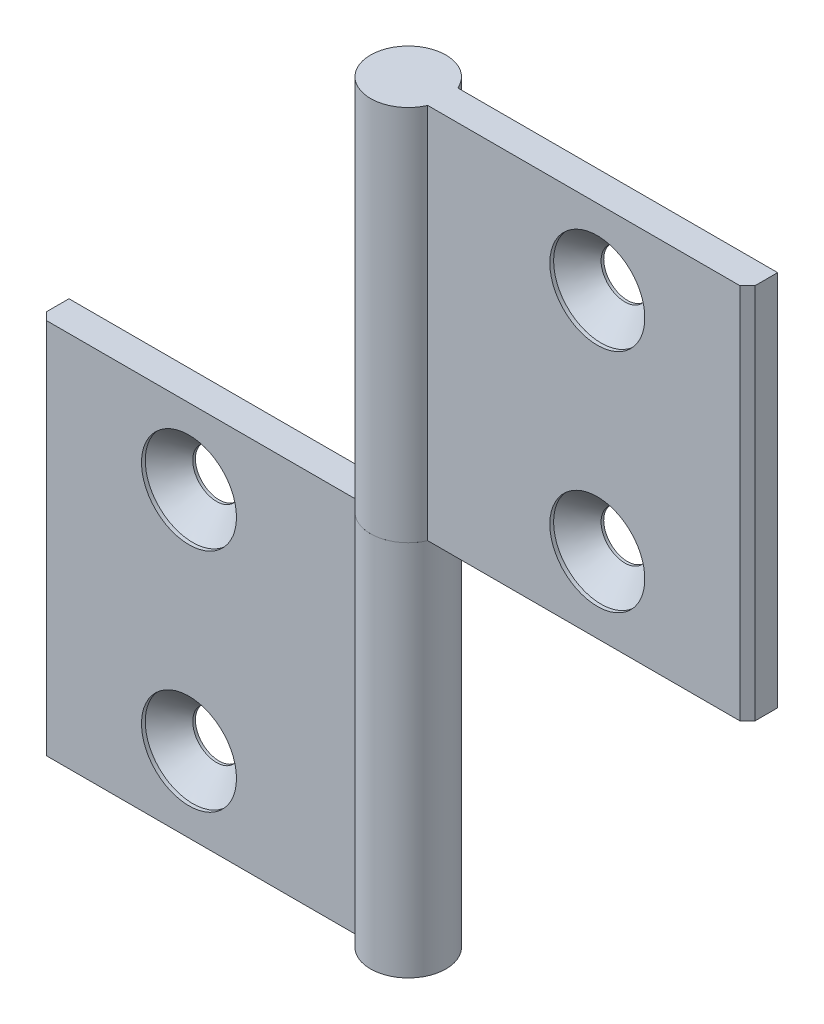
ISO-10303-21;
HEADER;
FILE_DESCRIPTION(('STEP AP214'),'2;1');
FILE_NAME('part.step','',(''),(''),'','','');
FILE_SCHEMA(('AUTOMOTIVE_DESIGN { 1 0 10303 214 1 1 1 1 }'));
ENDSEC;
DATA;
#1=APPLICATION_CONTEXT('core data for automotive mechanical design processes');
#2=APPLICATION_PROTOCOL_DEFINITION('international standard','automotive_design',2000,#1);
#3=PRODUCT_CONTEXT('',#1,'mechanical');
#4=PRODUCT('Part','Part','',(#3));
#5=PRODUCT_RELATED_PRODUCT_CATEGORY('part','',(#4));
#6=PRODUCT_DEFINITION_FORMATION('','',#4);
#7=PRODUCT_DEFINITION_CONTEXT('part definition',#1,'design');
#8=PRODUCT_DEFINITION('design','',#6,#7);
#9=PRODUCT_DEFINITION_SHAPE('','',#8);
#10=(LENGTH_UNIT() NAMED_UNIT(*) SI_UNIT(.MILLI.,.METRE.));
#11=(NAMED_UNIT(*) PLANE_ANGLE_UNIT() SI_UNIT($,.RADIAN.));
#12=(NAMED_UNIT(*) SI_UNIT($,.STERADIAN.) SOLID_ANGLE_UNIT());
#13=UNCERTAINTY_MEASURE_WITH_UNIT(LENGTH_MEASURE(1.E-05),#10,'distance_accuracy_value','');
#14=(GEOMETRIC_REPRESENTATION_CONTEXT(3) GLOBAL_UNCERTAINTY_ASSIGNED_CONTEXT((#13)) GLOBAL_UNIT_ASSIGNED_CONTEXT((#10,
#11,#12)) REPRESENTATION_CONTEXT('',''));
#15=CARTESIAN_POINT('',(0.,0.,0.));
#16=DIRECTION('',(0.,0.,1.));
#17=DIRECTION('',(1.,0.,0.));
#18=AXIS2_PLACEMENT_3D('',#15,#16,#17);
#19=CARTESIAN_POINT('',(0.,25.,0.));
#20=DIRECTION('',(0.,1.,0.));
#21=DIRECTION('',(0.,0.,-1.));
#22=AXIS2_PLACEMENT_3D('',#19,#20,#21);
#23=CYLINDRICAL_SURFACE('',#22,5.);
#24=CARTESIAN_POINT('',(0.,75.,0.));
#25=DIRECTION('',(0.,-1.,0.));
#26=DIRECTION('',(0.,0.,1.));
#27=AXIS2_PLACEMENT_3D('',#24,#25,#26);
#28=CIRCLE('',#27,5.);
#29=CARTESIAN_POINT('',(4.58257569495585,75.,1.99999999999997));
#30=VERTEX_POINT('',#29);
#31=CARTESIAN_POINT('',(4.58257569495582,75.,-2.00000000000004));
#32=VERTEX_POINT('',#31);
#33=EDGE_CURVE('E120',#30,#32,#28,.T.);
#34=ORIENTED_EDGE('',*,*,#33,.T.);
#35=DIRECTION('',(0.,1.,0.));
#36=VECTOR('',#35,1.);
#37=CARTESIAN_POINT('',(4.58257569495582,25.,-2.00000000000004));
#38=LINE('',#37,#36);
#39=CARTESIAN_POINT('',(4.58257569495582,25.,-2.00000000000004));
#40=VERTEX_POINT('',#39);
#41=EDGE_CURVE('E12',#40,#32,#38,.T.);
#42=ORIENTED_EDGE('',*,*,#41,.F.);
#43=CARTESIAN_POINT('',(0.,25.,0.));
#44=DIRECTION('',(0.,-1.,0.));
#45=DIRECTION('',(0.,0.,1.));
#46=AXIS2_PLACEMENT_3D('',#43,#44,#45);
#47=CIRCLE('',#46,5.);
#48=CARTESIAN_POINT('',(4.58257569495585,25.,1.99999999999997));
#49=VERTEX_POINT('',#48);
#50=EDGE_CURVE('E129',#49,#40,#47,.T.);
#51=ORIENTED_EDGE('',*,*,#50,.F.);
#52=DIRECTION('',(0.,1.,0.));
#53=VECTOR('',#52,1.);
#54=CARTESIAN_POINT('',(4.58257569495585,25.,1.99999999999997));
#55=LINE('',#54,#53);
#56=EDGE_CURVE('E116',#49,#30,#55,.T.);
#57=ORIENTED_EDGE('',*,*,#56,.T.);
#58=EDGE_LOOP('',(#34,#42,#51,#57));
#59=FACE_BOUND('',#58,.T.);
#60=ADVANCED_FACE('F44',(#59),#23,.T.);
#61=CARTESIAN_POINT('',(4.58257569495582,25.,-2.00000000000004));
#62=DIRECTION('',(0.,0.,1.));
#63=DIRECTION('',(-1.,0.,0.));
#64=AXIS2_PLACEMENT_3D('',#61,#62,#63);
#65=PLANE('',#64);
#66=CARTESIAN_POINT('',(27.0825756949558,35.,-2.0000000000002));
#67=DIRECTION('',(0.,0.,1.));
#68=DIRECTION('',(-1.,0.,0.));
#69=AXIS2_PLACEMENT_3D('',#66,#67,#68);
#70=CIRCLE('',#69,3.15);
#71=CARTESIAN_POINT('',(23.9325756949558,35.,-2.00000000000018));
#72=VERTEX_POINT('',#71);
#73=EDGE_CURVE('E47',#72,#72,#70,.T.);
#74=ORIENTED_EDGE('',*,*,#73,.T.);
#75=EDGE_LOOP('',(#74));
#76=FACE_BOUND('',#75,.T.);
#77=CARTESIAN_POINT('',(27.0825756949558,65.,-2.0000000000002));
#78=DIRECTION('',(0.,0.,1.));
#79=DIRECTION('',(-1.,0.,0.));
#80=AXIS2_PLACEMENT_3D('',#77,#78,#79);
#81=CIRCLE('',#80,3.15);
#82=CARTESIAN_POINT('',(23.9325756949558,65.,-2.00000000000018));
#83=VERTEX_POINT('',#82);
#84=EDGE_CURVE('E124',#83,#83,#81,.T.);
#85=ORIENTED_EDGE('',*,*,#84,.T.);
#86=EDGE_LOOP('',(#85));
#87=FACE_BOUND('',#86,.T.);
#88=DIRECTION('',(1.,0.,0.));
#89=VECTOR('',#88,1.);
#90=CARTESIAN_POINT('',(4.58257569495582,75.,-2.00000000000004));
#91=LINE('',#90,#89);
#92=CARTESIAN_POINT('',(47.,75.,-2.00000000000035));
#93=VERTEX_POINT('',#92);
#94=EDGE_CURVE('E123',#32,#93,#91,.T.);
#95=ORIENTED_EDGE('',*,*,#94,.T.);
#96=DIRECTION('',(0.,1.,0.));
#97=VECTOR('',#96,1.);
#98=CARTESIAN_POINT('',(47.,25.,-2.00000000000035));
#99=LINE('',#98,#97);
#100=CARTESIAN_POINT('',(47.,25.,-2.00000000000035));
#101=VERTEX_POINT('',#100);
#102=EDGE_CURVE('E53',#101,#93,#99,.T.);
#103=ORIENTED_EDGE('',*,*,#102,.F.);
#104=DIRECTION('',(1.,0.,0.));
#105=VECTOR('',#104,1.);
#106=CARTESIAN_POINT('',(4.58257569495582,25.,-2.00000000000004));
#107=LINE('',#106,#105);
#108=EDGE_CURVE('E96',#40,#101,#107,.T.);
#109=ORIENTED_EDGE('',*,*,#108,.F.);
#110=ORIENTED_EDGE('',*,*,#41,.T.);
#111=EDGE_LOOP('',(#95,#103,#109,#110));
#112=FACE_BOUND('',#111,.T.);
#113=ADVANCED_FACE('F150',(#76,#87,#112),#65,.F.);
#114=CARTESIAN_POINT('',(47.,25.,-2.00000000000035));
#115=DIRECTION('',(-1.,0.,0.));
#116=DIRECTION('',(0.,0.,-1.));
#117=AXIS2_PLACEMENT_3D('',#114,#115,#116);
#118=PLANE('',#117);
#119=DIRECTION('',(0.,0.,1.));
#120=VECTOR('',#119,1.);
#121=CARTESIAN_POINT('',(47.,75.,-2.00000000000035));
#122=LINE('',#121,#120);
#123=CARTESIAN_POINT('',(47.,75.,0.999999999999653));
#124=VERTEX_POINT('',#123);
#125=EDGE_CURVE('E111',#93,#124,#122,.T.);
#126=ORIENTED_EDGE('',*,*,#125,.T.);
#127=DIRECTION('',(0.,1.,0.));
#128=VECTOR('',#127,1.);
#129=CARTESIAN_POINT('',(47.,25.,0.999999999999653));
#130=LINE('',#129,#128);
#131=CARTESIAN_POINT('',(47.,25.,0.999999999999653));
#132=VERTEX_POINT('',#131);
#133=EDGE_CURVE('E108',#132,#124,#130,.T.);
#134=ORIENTED_EDGE('',*,*,#133,.F.);
#135=DIRECTION('',(0.,0.,1.));
#136=VECTOR('',#135,1.);
#137=CARTESIAN_POINT('',(47.,25.,-2.00000000000035));
#138=LINE('',#137,#136);
#139=EDGE_CURVE('E100',#101,#132,#138,.T.);
#140=ORIENTED_EDGE('',*,*,#139,.F.);
#141=ORIENTED_EDGE('',*,*,#102,.T.);
#142=EDGE_LOOP('',(#126,#134,#140,#141));
#143=FACE_BOUND('',#142,.T.);
#144=ADVANCED_FACE('F109',(#143),#118,.F.);
#145=CARTESIAN_POINT('',(47.,25.,0.999999999999653));
#146=DIRECTION('',(-0.707106781186549,0.,-0.707106781186546));
#147=DIRECTION('',(0.707106781186546,0.,-0.707106781186549));
#148=AXIS2_PLACEMENT_3D('',#145,#146,#147);
#149=PLANE('',#148);
#150=DIRECTION('',(-0.707106781186546,0.,0.707106781186549));
#151=VECTOR('',#150,1.);
#152=CARTESIAN_POINT('',(47.,75.,0.999999999999653));
#153=LINE('',#152,#151);
#154=CARTESIAN_POINT('',(46.,75.,1.99999999999965));
#155=VERTEX_POINT('',#154);
#156=EDGE_CURVE('E82',#124,#155,#153,.T.);
#157=ORIENTED_EDGE('',*,*,#156,.T.);
#158=DIRECTION('',(0.,1.,0.));
#159=VECTOR('',#158,1.);
#160=CARTESIAN_POINT('',(46.,25.,1.99999999999965));
#161=LINE('',#160,#159);
#162=CARTESIAN_POINT('',(46.,25.,1.99999999999965));
#163=VERTEX_POINT('',#162);
#164=EDGE_CURVE('E112',#163,#155,#161,.T.);
#165=ORIENTED_EDGE('',*,*,#164,.F.);
#166=DIRECTION('',(-0.707106781186546,0.,0.707106781186549));
#167=VECTOR('',#166,1.);
#168=CARTESIAN_POINT('',(47.,25.,0.999999999999653));
#169=LINE('',#168,#167);
#170=EDGE_CURVE('E104',#132,#163,#169,.T.);
#171=ORIENTED_EDGE('',*,*,#170,.F.);
#172=ORIENTED_EDGE('',*,*,#133,.T.);
#173=EDGE_LOOP('',(#157,#165,#171,#172));
#174=FACE_BOUND('',#173,.T.);
#175=ADVANCED_FACE('F114',(#174),#149,.F.);
#176=CARTESIAN_POINT('',(46.,25.,1.99999999999965));
#177=DIRECTION('',(0.,0.,-1.));
#178=DIRECTION('',(1.,0.,0.));
#179=AXIS2_PLACEMENT_3D('',#176,#177,#178);
#180=PLANE('',#179);
#181=CARTESIAN_POINT('',(27.0825756949558,35.,1.9999999999998));
#182=DIRECTION('',(0.,0.,1.));
#183=DIRECTION('',(-1.,0.,0.));
#184=AXIS2_PLACEMENT_3D('',#181,#182,#183);
#185=CIRCLE('',#184,6.3);
#186=CARTESIAN_POINT('',(20.7825756949559,35.,1.99999999999985));
#187=VERTEX_POINT('',#186);
#188=EDGE_CURVE('E184',#187,#187,#185,.T.);
#189=ORIENTED_EDGE('',*,*,#188,.F.);
#190=EDGE_LOOP('',(#189));
#191=FACE_BOUND('',#190,.T.);
#192=CARTESIAN_POINT('',(27.0825756949558,65.,1.9999999999998));
#193=DIRECTION('',(0.,0.,1.));
#194=DIRECTION('',(-1.,0.,0.));
#195=AXIS2_PLACEMENT_3D('',#192,#193,#194);
#196=CIRCLE('',#195,6.3);
#197=CARTESIAN_POINT('',(20.7825756949559,65.,1.99999999999985));
#198=VERTEX_POINT('',#197);
#199=EDGE_CURVE('E142',#198,#198,#196,.T.);
#200=ORIENTED_EDGE('',*,*,#199,.F.);
#201=EDGE_LOOP('',(#200));
#202=FACE_BOUND('',#201,.T.);
#203=DIRECTION('',(-1.,0.,0.));
#204=VECTOR('',#203,1.);
#205=CARTESIAN_POINT('',(46.,75.,1.99999999999965));
#206=LINE('',#205,#204);
#207=EDGE_CURVE('E88',#155,#30,#206,.T.);
#208=ORIENTED_EDGE('',*,*,#207,.T.);
#209=ORIENTED_EDGE('',*,*,#56,.F.);
#210=DIRECTION('',(-1.,0.,0.));
#211=VECTOR('',#210,1.);
#212=CARTESIAN_POINT('',(46.,25.,1.99999999999965));
#213=LINE('',#212,#211);
#214=EDGE_CURVE('E62',#163,#49,#213,.T.);
#215=ORIENTED_EDGE('',*,*,#214,.F.);
#216=ORIENTED_EDGE('',*,*,#164,.T.);
#217=EDGE_LOOP('',(#208,#209,#215,#216));
#218=FACE_BOUND('',#217,.T.);
#219=ADVANCED_FACE('F162',(#191,#202,#218),#180,.F.);
#220=CARTESIAN_POINT('',(0.,25.,0.));
#221=DIRECTION('',(0.,-1.,0.));
#222=DIRECTION('',(0.,0.,1.));
#223=AXIS2_PLACEMENT_3D('',#220,#221,#222);
#224=PLANE('',#223);
#225=ORIENTED_EDGE('',*,*,#50,.T.);
#226=ORIENTED_EDGE('',*,*,#108,.T.);
#227=ORIENTED_EDGE('',*,*,#139,.T.);
#228=ORIENTED_EDGE('',*,*,#170,.T.);
#229=ORIENTED_EDGE('',*,*,#214,.T.);
#230=EDGE_LOOP('',(#225,#226,#227,#228,#229));
#231=FACE_BOUND('',#230,.T.);
#232=ADVANCED_FACE('F102',(#231),#224,.T.);
#233=CARTESIAN_POINT('',(0.,75.,0.));
#234=DIRECTION('',(0.,-1.,0.));
#235=DIRECTION('',(0.,0.,1.));
#236=AXIS2_PLACEMENT_3D('',#233,#234,#235);
#237=PLANE('',#236);
#238=ORIENTED_EDGE('',*,*,#33,.F.);
#239=ORIENTED_EDGE('',*,*,#207,.F.);
#240=ORIENTED_EDGE('',*,*,#156,.F.);
#241=ORIENTED_EDGE('',*,*,#125,.F.);
#242=ORIENTED_EDGE('',*,*,#94,.F.);
#243=EDGE_LOOP('',(#238,#239,#240,#241,#242));
#244=FACE_BOUND('',#243,.T.);
#245=ADVANCED_FACE('F152',(#244),#237,.F.);
#246=CARTESIAN_POINT('',(27.0825756949558,65.,1.9999999999998));
#247=DIRECTION('',(0.,0.,1.));
#248=DIRECTION('',(-1.,0.,0.));
#249=AXIS2_PLACEMENT_3D('',#246,#247,#248);
#250=CYLINDRICAL_SURFACE('',#249,3.15);
#251=CARTESIAN_POINT('',(27.0825756949558,65.,-1.6500000000002));
#252=DIRECTION('',(0.,0.,1.));
#253=DIRECTION('',(-1.,0.,0.));
#254=AXIS2_PLACEMENT_3D('',#251,#252,#253);
#255=CIRCLE('',#254,3.15);
#256=CARTESIAN_POINT('',(23.9325756949558,65.,-1.65000000000018));
#257=VERTEX_POINT('',#256);
#258=EDGE_CURVE('E133',#257,#257,#255,.T.);
#259=ORIENTED_EDGE('',*,*,#258,.T.);
#260=EDGE_LOOP('',(#259));
#261=FACE_BOUND('',#260,.T.);
#262=ORIENTED_EDGE('',*,*,#84,.F.);
#263=EDGE_LOOP('',(#262));
#264=FACE_BOUND('',#263,.T.);
#265=ADVANCED_FACE('F154',(#261,#264),#250,.F.);
#266=CARTESIAN_POINT('',(27.0825756949558,65.,1.4999999999998));
#267=DIRECTION('',(0.,0.,1.));
#268=DIRECTION('',(-1.,0.,0.));
#269=AXIS2_PLACEMENT_3D('',#266,#267,#268);
#270=CONICAL_SURFACE('',#269,6.3,0.785398163397449);
#271=ORIENTED_EDGE('',*,*,#258,.F.);
#272=EDGE_LOOP('',(#271));
#273=FACE_BOUND('',#272,.T.);
#274=CARTESIAN_POINT('',(27.0825756949558,65.,1.4999999999998));
#275=DIRECTION('',(0.,0.,1.));
#276=DIRECTION('',(-1.,0.,0.));
#277=AXIS2_PLACEMENT_3D('',#274,#275,#276);
#278=CIRCLE('',#277,6.3);
#279=CARTESIAN_POINT('',(20.7825756949558,65.,1.49999999999985));
#280=VERTEX_POINT('',#279);
#281=EDGE_CURVE('E137',#280,#280,#278,.T.);
#282=ORIENTED_EDGE('',*,*,#281,.T.);
#283=EDGE_LOOP('',(#282));
#284=FACE_BOUND('',#283,.T.);
#285=ADVANCED_FACE('F160',(#273,#284),#270,.F.);
#286=CARTESIAN_POINT('',(27.0825756949558,65.,1.9999999999998));
#287=DIRECTION('',(0.,0.,1.));
#288=DIRECTION('',(-1.,0.,0.));
#289=AXIS2_PLACEMENT_3D('',#286,#287,#288);
#290=CYLINDRICAL_SURFACE('',#289,6.3);
#291=ORIENTED_EDGE('',*,*,#281,.F.);
#292=EDGE_LOOP('',(#291));
#293=FACE_BOUND('',#292,.T.);
#294=ORIENTED_EDGE('',*,*,#199,.T.);
#295=EDGE_LOOP('',(#294));
#296=FACE_BOUND('',#295,.T.);
#297=ADVANCED_FACE('F211',(#293,#296),#290,.F.);
#298=CARTESIAN_POINT('',(27.0825756949558,35.,1.9999999999998));
#299=DIRECTION('',(0.,0.,1.));
#300=DIRECTION('',(-1.,0.,0.));
#301=AXIS2_PLACEMENT_3D('',#298,#299,#300);
#302=CYLINDRICAL_SURFACE('',#301,3.15);
#303=CARTESIAN_POINT('',(27.0825756949558,35.,-1.6500000000002));
#304=DIRECTION('',(0.,0.,1.));
#305=DIRECTION('',(-1.,0.,0.));
#306=AXIS2_PLACEMENT_3D('',#303,#304,#305);
#307=CIRCLE('',#306,3.15);
#308=CARTESIAN_POINT('',(23.9325756949558,35.,-1.65000000000018));
#309=VERTEX_POINT('',#308);
#310=EDGE_CURVE('E188',#309,#309,#307,.T.);
#311=ORIENTED_EDGE('',*,*,#310,.T.);
#312=EDGE_LOOP('',(#311));
#313=FACE_BOUND('',#312,.T.);
#314=ORIENTED_EDGE('',*,*,#73,.F.);
#315=EDGE_LOOP('',(#314));
#316=FACE_BOUND('',#315,.T.);
#317=ADVANCED_FACE('F204',(#313,#316),#302,.F.);
#318=CARTESIAN_POINT('',(27.0825756949558,35.,1.4999999999998));
#319=DIRECTION('',(0.,0.,1.));
#320=DIRECTION('',(-1.,0.,0.));
#321=AXIS2_PLACEMENT_3D('',#318,#319,#320);
#322=CONICAL_SURFACE('',#321,6.3,0.785398163397449);
#323=ORIENTED_EDGE('',*,*,#310,.F.);
#324=EDGE_LOOP('',(#323));
#325=FACE_BOUND('',#324,.T.);
#326=CARTESIAN_POINT('',(27.0825756949558,35.,1.4999999999998));
#327=DIRECTION('',(0.,0.,1.));
#328=DIRECTION('',(-1.,0.,0.));
#329=AXIS2_PLACEMENT_3D('',#326,#327,#328);
#330=CIRCLE('',#329,6.3);
#331=CARTESIAN_POINT('',(20.7825756949558,35.,1.49999999999985));
#332=VERTEX_POINT('',#331);
#333=EDGE_CURVE('E192',#332,#332,#330,.T.);
#334=ORIENTED_EDGE('',*,*,#333,.T.);
#335=EDGE_LOOP('',(#334));
#336=FACE_BOUND('',#335,.T.);
#337=ADVANCED_FACE('F198',(#325,#336),#322,.F.);
#338=CARTESIAN_POINT('',(27.0825756949558,35.,1.9999999999998));
#339=DIRECTION('',(0.,0.,1.));
#340=DIRECTION('',(-1.,0.,0.));
#341=AXIS2_PLACEMENT_3D('',#338,#339,#340);
#342=CYLINDRICAL_SURFACE('',#341,6.3);
#343=ORIENTED_EDGE('',*,*,#333,.F.);
#344=EDGE_LOOP('',(#343));
#345=FACE_BOUND('',#344,.T.);
#346=ORIENTED_EDGE('',*,*,#188,.T.);
#347=EDGE_LOOP('',(#346));
#348=FACE_BOUND('',#347,.T.);
#349=ADVANCED_FACE('F196',(#345,#348),#342,.F.);
#350=CLOSED_SHELL('',(#60,#113,#144,#175,#219,#232,#245,#265,#285,#297,#317,#337,#349));
#351=MANIFOLD_SOLID_BREP('B2',#350);
#352=CARTESIAN_POINT('',(0.,25.,0.));
#353=DIRECTION('',(0.,-1.,0.));
#354=DIRECTION('',(0.,0.,-1.));
#355=AXIS2_PLACEMENT_3D('',#352,#353,#354);
#356=CYLINDRICAL_SURFACE('',#355,5.);
#357=CARTESIAN_POINT('',(0.,-25.,0.));
#358=DIRECTION('',(0.,1.,0.));
#359=DIRECTION('',(0.,0.,1.));
#360=AXIS2_PLACEMENT_3D('',#357,#358,#359);
#361=CIRCLE('',#360,5.);
#362=CARTESIAN_POINT('',(-4.58257569495584,-25.,2.));
#363=VERTEX_POINT('',#362);
#364=CARTESIAN_POINT('',(-4.58257569495584,-25.,-2.));
#365=VERTEX_POINT('',#364);
#366=EDGE_CURVE('E371',#363,#365,#361,.T.);
#367=ORIENTED_EDGE('',*,*,#366,.T.);
#368=DIRECTION('',(0.,-1.,0.));
#369=VECTOR('',#368,1.);
#370=CARTESIAN_POINT('',(-4.58257569495584,25.,-2.));
#371=LINE('',#370,#369);
#372=CARTESIAN_POINT('',(-4.58257569495584,25.,-2.));
#373=VERTEX_POINT('',#372);
#374=EDGE_CURVE('E42',#373,#365,#371,.T.);
#375=ORIENTED_EDGE('',*,*,#374,.F.);
#376=CARTESIAN_POINT('',(0.,25.,0.));
#377=DIRECTION('',(0.,1.,0.));
#378=DIRECTION('',(0.,0.,1.));
#379=AXIS2_PLACEMENT_3D('',#376,#377,#378);
#380=CIRCLE('',#379,5.);
#381=CARTESIAN_POINT('',(-4.58257569495584,25.,2.));
#382=VERTEX_POINT('',#381);
#383=EDGE_CURVE('E380',#382,#373,#380,.T.);
#384=ORIENTED_EDGE('',*,*,#383,.F.);
#385=DIRECTION('',(0.,-1.,0.));
#386=VECTOR('',#385,1.);
#387=CARTESIAN_POINT('',(-4.58257569495584,25.,2.));
#388=LINE('',#387,#386);
#389=EDGE_CURVE('E367',#382,#363,#388,.T.);
#390=ORIENTED_EDGE('',*,*,#389,.T.);
#391=EDGE_LOOP('',(#367,#375,#384,#390));
#392=FACE_BOUND('',#391,.T.);
#393=ADVANCED_FACE('F295',(#392),#356,.T.);
#394=CARTESIAN_POINT('',(-4.58257569495584,25.,-2.));
#395=DIRECTION('',(0.,0.,1.));
#396=DIRECTION('',(1.,0.,0.));
#397=AXIS2_PLACEMENT_3D('',#394,#395,#396);
#398=PLANE('',#397);
#399=CARTESIAN_POINT('',(-27.0825756949558,15.,-2.));
#400=DIRECTION('',(0.,0.,1.));
#401=DIRECTION('',(1.,0.,0.));
#402=AXIS2_PLACEMENT_3D('',#399,#400,#401);
#403=CIRCLE('',#402,3.15);
#404=CARTESIAN_POINT('',(-23.9325756949558,15.,-2.));
#405=VERTEX_POINT('',#404);
#406=EDGE_CURVE('E298',#405,#405,#403,.T.);
#407=ORIENTED_EDGE('',*,*,#406,.T.);
#408=EDGE_LOOP('',(#407));
#409=FACE_BOUND('',#408,.T.);
#410=CARTESIAN_POINT('',(-27.0825756949558,-15.,-2.));
#411=DIRECTION('',(0.,0.,1.));
#412=DIRECTION('',(1.,0.,0.));
#413=AXIS2_PLACEMENT_3D('',#410,#411,#412);
#414=CIRCLE('',#413,3.15);
#415=CARTESIAN_POINT('',(-23.9325756949558,-15.,-2.));
#416=VERTEX_POINT('',#415);
#417=EDGE_CURVE('E375',#416,#416,#414,.T.);
#418=ORIENTED_EDGE('',*,*,#417,.T.);
#419=EDGE_LOOP('',(#418));
#420=FACE_BOUND('',#419,.T.);
#421=DIRECTION('',(-1.,0.,0.));
#422=VECTOR('',#421,1.);
#423=CARTESIAN_POINT('',(-4.58257569495584,-25.,-2.));
#424=LINE('',#423,#422);
#425=CARTESIAN_POINT('',(-47.,-25.,-2.));
#426=VERTEX_POINT('',#425);
#427=EDGE_CURVE('E374',#365,#426,#424,.T.);
#428=ORIENTED_EDGE('',*,*,#427,.T.);
#429=DIRECTION('',(0.,-1.,0.));
#430=VECTOR('',#429,1.);
#431=CARTESIAN_POINT('',(-47.,25.,-2.));
#432=LINE('',#431,#430);
#433=CARTESIAN_POINT('',(-47.,25.,-2.));
#434=VERTEX_POINT('',#433);
#435=EDGE_CURVE('E304',#434,#426,#432,.T.);
#436=ORIENTED_EDGE('',*,*,#435,.F.);
#437=DIRECTION('',(-1.,0.,0.));
#438=VECTOR('',#437,1.);
#439=CARTESIAN_POINT('',(-4.58257569495584,25.,-2.));
#440=LINE('',#439,#438);
#441=EDGE_CURVE('E347',#373,#434,#440,.T.);
#442=ORIENTED_EDGE('',*,*,#441,.F.);
#443=ORIENTED_EDGE('',*,*,#374,.T.);
#444=EDGE_LOOP('',(#428,#436,#442,#443));
#445=FACE_BOUND('',#444,.T.);
#446=ADVANCED_FACE('F401',(#409,#420,#445),#398,.F.);
#447=CARTESIAN_POINT('',(-47.,25.,-2.));
#448=DIRECTION('',(1.,0.,0.));
#449=DIRECTION('',(0.,0.,-1.));
#450=AXIS2_PLACEMENT_3D('',#447,#448,#449);
#451=PLANE('',#450);
#452=DIRECTION('',(0.,0.,1.));
#453=VECTOR('',#452,1.);
#454=CARTESIAN_POINT('',(-47.,-25.,-2.));
#455=LINE('',#454,#453);
#456=CARTESIAN_POINT('',(-47.,-25.,1.));
#457=VERTEX_POINT('',#456);
#458=EDGE_CURVE('E362',#426,#457,#455,.T.);
#459=ORIENTED_EDGE('',*,*,#458,.T.);
#460=DIRECTION('',(0.,-1.,0.));
#461=VECTOR('',#460,1.);
#462=CARTESIAN_POINT('',(-47.,25.,1.));
#463=LINE('',#462,#461);
#464=CARTESIAN_POINT('',(-47.,25.,1.));
#465=VERTEX_POINT('',#464);
#466=EDGE_CURVE('E359',#465,#457,#463,.T.);
#467=ORIENTED_EDGE('',*,*,#466,.F.);
#468=DIRECTION('',(0.,0.,1.));
#469=VECTOR('',#468,1.);
#470=CARTESIAN_POINT('',(-47.,25.,-2.));
#471=LINE('',#470,#469);
#472=EDGE_CURVE('E351',#434,#465,#471,.T.);
#473=ORIENTED_EDGE('',*,*,#472,.F.);
#474=ORIENTED_EDGE('',*,*,#435,.T.);
#475=EDGE_LOOP('',(#459,#467,#473,#474));
#476=FACE_BOUND('',#475,.T.);
#477=ADVANCED_FACE('F360',(#476),#451,.F.);
#478=CARTESIAN_POINT('',(-47.,25.,1.));
#479=DIRECTION('',(0.707106781186544,0.,-0.707106781186551));
#480=DIRECTION('',(-0.707106781186551,0.,-0.707106781186544));
#481=AXIS2_PLACEMENT_3D('',#478,#479,#480);
#482=PLANE('',#481);
#483=DIRECTION('',(0.707106781186551,0.,0.707106781186544));
#484=VECTOR('',#483,1.);
#485=CARTESIAN_POINT('',(-47.,-25.,1.));
#486=LINE('',#485,#484);
#487=CARTESIAN_POINT('',(-46.,-25.,2.));
#488=VERTEX_POINT('',#487);
#489=EDGE_CURVE('E333',#457,#488,#486,.T.);
#490=ORIENTED_EDGE('',*,*,#489,.T.);
#491=DIRECTION('',(0.,-1.,0.));
#492=VECTOR('',#491,1.);
#493=CARTESIAN_POINT('',(-46.,25.,2.));
#494=LINE('',#493,#492);
#495=CARTESIAN_POINT('',(-46.,25.,2.));
#496=VERTEX_POINT('',#495);
#497=EDGE_CURVE('E363',#496,#488,#494,.T.);
#498=ORIENTED_EDGE('',*,*,#497,.F.);
#499=DIRECTION('',(0.707106781186551,0.,0.707106781186544));
#500=VECTOR('',#499,1.);
#501=CARTESIAN_POINT('',(-47.,25.,1.));
#502=LINE('',#501,#500);
#503=EDGE_CURVE('E355',#465,#496,#502,.T.);
#504=ORIENTED_EDGE('',*,*,#503,.F.);
#505=ORIENTED_EDGE('',*,*,#466,.T.);
#506=EDGE_LOOP('',(#490,#498,#504,#505));
#507=FACE_BOUND('',#506,.T.);
#508=ADVANCED_FACE('F365',(#507),#482,.F.);
#509=CARTESIAN_POINT('',(-46.,25.,2.));
#510=DIRECTION('',(0.,0.,-1.));
#511=DIRECTION('',(-1.,0.,0.));
#512=AXIS2_PLACEMENT_3D('',#509,#510,#511);
#513=PLANE('',#512);
#514=CARTESIAN_POINT('',(-27.0825756949558,15.,2.));
#515=DIRECTION('',(0.,0.,1.));
#516=DIRECTION('',(1.,0.,0.));
#517=AXIS2_PLACEMENT_3D('',#514,#515,#516);
#518=CIRCLE('',#517,6.3);
#519=CARTESIAN_POINT('',(-20.7825756949558,15.,2.));
#520=VERTEX_POINT('',#519);
#521=EDGE_CURVE('E435',#520,#520,#518,.T.);
#522=ORIENTED_EDGE('',*,*,#521,.F.);
#523=EDGE_LOOP('',(#522));
#524=FACE_BOUND('',#523,.T.);
#525=CARTESIAN_POINT('',(-27.0825756949558,-15.,2.));
#526=DIRECTION('',(0.,0.,1.));
#527=DIRECTION('',(1.,0.,0.));
#528=AXIS2_PLACEMENT_3D('',#525,#526,#527);
#529=CIRCLE('',#528,6.3);
#530=CARTESIAN_POINT('',(-20.7825756949558,-15.,2.));
#531=VERTEX_POINT('',#530);
#532=EDGE_CURVE('E393',#531,#531,#529,.T.);
#533=ORIENTED_EDGE('',*,*,#532,.F.);
#534=EDGE_LOOP('',(#533));
#535=FACE_BOUND('',#534,.T.);
#536=DIRECTION('',(1.,0.,0.));
#537=VECTOR('',#536,1.);
#538=CARTESIAN_POINT('',(-46.,-25.,2.));
#539=LINE('',#538,#537);
#540=EDGE_CURVE('E339',#488,#363,#539,.T.);
#541=ORIENTED_EDGE('',*,*,#540,.T.);
#542=ORIENTED_EDGE('',*,*,#389,.F.);
#543=DIRECTION('',(1.,0.,0.));
#544=VECTOR('',#543,1.);
#545=CARTESIAN_POINT('',(-46.,25.,2.));
#546=LINE('',#545,#544);
#547=EDGE_CURVE('E313',#496,#382,#546,.T.);
#548=ORIENTED_EDGE('',*,*,#547,.F.);
#549=ORIENTED_EDGE('',*,*,#497,.T.);
#550=EDGE_LOOP('',(#541,#542,#548,#549));
#551=FACE_BOUND('',#550,.T.);
#552=ADVANCED_FACE('F413',(#524,#535,#551),#513,.F.);
#553=CARTESIAN_POINT('',(0.,25.,0.));
#554=DIRECTION('',(0.,1.,0.));
#555=DIRECTION('',(0.,0.,1.));
#556=AXIS2_PLACEMENT_3D('',#553,#554,#555);
#557=PLANE('',#556);
#558=ORIENTED_EDGE('',*,*,#383,.T.);
#559=ORIENTED_EDGE('',*,*,#441,.T.);
#560=ORIENTED_EDGE('',*,*,#472,.T.);
#561=ORIENTED_EDGE('',*,*,#503,.T.);
#562=ORIENTED_EDGE('',*,*,#547,.T.);
#563=EDGE_LOOP('',(#558,#559,#560,#561,#562));
#564=FACE_BOUND('',#563,.T.);
#565=ADVANCED_FACE('F353',(#564),#557,.T.);
#566=CARTESIAN_POINT('',(0.,-25.,0.));
#567=DIRECTION('',(0.,1.,0.));
#568=DIRECTION('',(0.,0.,1.));
#569=AXIS2_PLACEMENT_3D('',#566,#567,#568);
#570=PLANE('',#569);
#571=ORIENTED_EDGE('',*,*,#366,.F.);
#572=ORIENTED_EDGE('',*,*,#540,.F.);
#573=ORIENTED_EDGE('',*,*,#489,.F.);
#574=ORIENTED_EDGE('',*,*,#458,.F.);
#575=ORIENTED_EDGE('',*,*,#427,.F.);
#576=EDGE_LOOP('',(#571,#572,#573,#574,#575));
#577=FACE_BOUND('',#576,.T.);
#578=ADVANCED_FACE('F403',(#577),#570,.F.);
#579=CARTESIAN_POINT('',(-27.0825756949558,-15.,2.));
#580=DIRECTION('',(0.,0.,1.));
#581=DIRECTION('',(1.,0.,0.));
#582=AXIS2_PLACEMENT_3D('',#579,#580,#581);
#583=CYLINDRICAL_SURFACE('',#582,3.15);
#584=CARTESIAN_POINT('',(-27.0825756949558,-15.,-1.65));
#585=DIRECTION('',(0.,0.,1.));
#586=DIRECTION('',(1.,0.,0.));
#587=AXIS2_PLACEMENT_3D('',#584,#585,#586);
#588=CIRCLE('',#587,3.15);
#589=CARTESIAN_POINT('',(-23.9325756949558,-15.,-1.65));
#590=VERTEX_POINT('',#589);
#591=EDGE_CURVE('E384',#590,#590,#588,.T.);
#592=ORIENTED_EDGE('',*,*,#591,.T.);
#593=EDGE_LOOP('',(#592));
#594=FACE_BOUND('',#593,.T.);
#595=ORIENTED_EDGE('',*,*,#417,.F.);
#596=EDGE_LOOP('',(#595));
#597=FACE_BOUND('',#596,.T.);
#598=ADVANCED_FACE('F405',(#594,#597),#583,.F.);
#599=CARTESIAN_POINT('',(-27.0825756949558,-15.,1.5));
#600=DIRECTION('',(0.,0.,1.));
#601=DIRECTION('',(1.,0.,0.));
#602=AXIS2_PLACEMENT_3D('',#599,#600,#601);
#603=CONICAL_SURFACE('',#602,6.3,0.785398163397449);
#604=ORIENTED_EDGE('',*,*,#591,.F.);
#605=EDGE_LOOP('',(#604));
#606=FACE_BOUND('',#605,.T.);
#607=CARTESIAN_POINT('',(-27.0825756949558,-15.,1.5));
#608=DIRECTION('',(0.,0.,1.));
#609=DIRECTION('',(1.,0.,0.));
#610=AXIS2_PLACEMENT_3D('',#607,#608,#609);
#611=CIRCLE('',#610,6.3);
#612=CARTESIAN_POINT('',(-20.7825756949558,-15.,1.5));
#613=VERTEX_POINT('',#612);
#614=EDGE_CURVE('E388',#613,#613,#611,.T.);
#615=ORIENTED_EDGE('',*,*,#614,.T.);
#616=EDGE_LOOP('',(#615));
#617=FACE_BOUND('',#616,.T.);
#618=ADVANCED_FACE('F411',(#606,#617),#603,.F.);
#619=CARTESIAN_POINT('',(-27.0825756949558,-15.,2.));
#620=DIRECTION('',(0.,0.,1.));
#621=DIRECTION('',(1.,0.,0.));
#622=AXIS2_PLACEMENT_3D('',#619,#620,#621);
#623=CYLINDRICAL_SURFACE('',#622,6.3);
#624=ORIENTED_EDGE('',*,*,#614,.F.);
#625=EDGE_LOOP('',(#624));
#626=FACE_BOUND('',#625,.T.);
#627=ORIENTED_EDGE('',*,*,#532,.T.);
#628=EDGE_LOOP('',(#627));
#629=FACE_BOUND('',#628,.T.);
#630=ADVANCED_FACE('F462',(#626,#629),#623,.F.);
#631=CARTESIAN_POINT('',(-27.0825756949558,15.,2.));
#632=DIRECTION('',(0.,0.,1.));
#633=DIRECTION('',(1.,0.,0.));
#634=AXIS2_PLACEMENT_3D('',#631,#632,#633);
#635=CYLINDRICAL_SURFACE('',#634,3.15);
#636=CARTESIAN_POINT('',(-27.0825756949558,15.,-1.65));
#637=DIRECTION('',(0.,0.,1.));
#638=DIRECTION('',(1.,0.,0.));
#639=AXIS2_PLACEMENT_3D('',#636,#637,#638);
#640=CIRCLE('',#639,3.15);
#641=CARTESIAN_POINT('',(-23.9325756949558,15.,-1.65));
#642=VERTEX_POINT('',#641);
#643=EDGE_CURVE('E439',#642,#642,#640,.T.);
#644=ORIENTED_EDGE('',*,*,#643,.T.);
#645=EDGE_LOOP('',(#644));
#646=FACE_BOUND('',#645,.T.);
#647=ORIENTED_EDGE('',*,*,#406,.F.);
#648=EDGE_LOOP('',(#647));
#649=FACE_BOUND('',#648,.T.);
#650=ADVANCED_FACE('F455',(#646,#649),#635,.F.);
#651=CARTESIAN_POINT('',(-27.0825756949558,15.,1.5));
#652=DIRECTION('',(0.,0.,1.));
#653=DIRECTION('',(1.,0.,0.));
#654=AXIS2_PLACEMENT_3D('',#651,#652,#653);
#655=CONICAL_SURFACE('',#654,6.3,0.785398163397449);
#656=ORIENTED_EDGE('',*,*,#643,.F.);
#657=EDGE_LOOP('',(#656));
#658=FACE_BOUND('',#657,.T.);
#659=CARTESIAN_POINT('',(-27.0825756949558,15.,1.5));
#660=DIRECTION('',(0.,0.,1.));
#661=DIRECTION('',(1.,0.,0.));
#662=AXIS2_PLACEMENT_3D('',#659,#660,#661);
#663=CIRCLE('',#662,6.3);
#664=CARTESIAN_POINT('',(-20.7825756949558,15.,1.5));
#665=VERTEX_POINT('',#664);
#666=EDGE_CURVE('E443',#665,#665,#663,.T.);
#667=ORIENTED_EDGE('',*,*,#666,.T.);
#668=EDGE_LOOP('',(#667));
#669=FACE_BOUND('',#668,.T.);
#670=ADVANCED_FACE('F449',(#658,#669),#655,.F.);
#671=CARTESIAN_POINT('',(-27.0825756949558,15.,2.));
#672=DIRECTION('',(0.,0.,1.));
#673=DIRECTION('',(1.,0.,0.));
#674=AXIS2_PLACEMENT_3D('',#671,#672,#673);
#675=CYLINDRICAL_SURFACE('',#674,6.3);
#676=ORIENTED_EDGE('',*,*,#666,.F.);
#677=EDGE_LOOP('',(#676));
#678=FACE_BOUND('',#677,.T.);
#679=ORIENTED_EDGE('',*,*,#521,.T.);
#680=EDGE_LOOP('',(#679));
#681=FACE_BOUND('',#680,.T.);
#682=ADVANCED_FACE('F447',(#678,#681),#675,.F.);
#683=CLOSED_SHELL('',(#393,#446,#477,#508,#552,#565,#578,#598,#618,#630,#650,#670,#682));
#684=MANIFOLD_SOLID_BREP('B6',#683);
#685=ADVANCED_BREP_SHAPE_REPRESENTATION('',(#18,#351,#684),#14);
#686=SHAPE_DEFINITION_REPRESENTATION(#9,#685);
ENDSEC;
END-ISO-10303-21;
